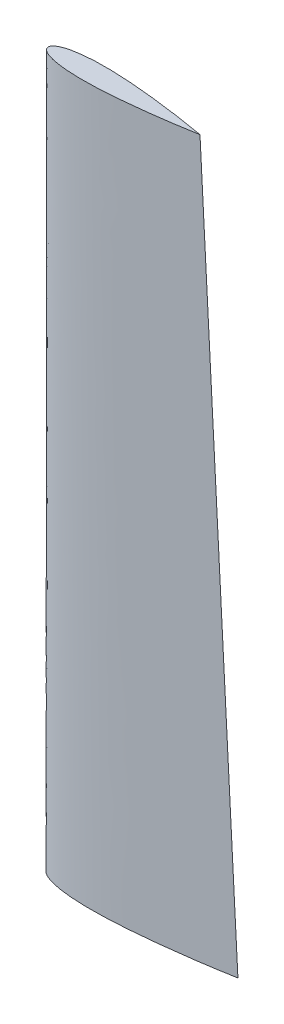
ISO-10303-21;
HEADER;
FILE_DESCRIPTION(('STEP AP214'),'2;1');
FILE_NAME('part.step','',(''),(''),'','','');
FILE_SCHEMA(('AUTOMOTIVE_DESIGN { 1 0 10303 214 1 1 1 1 }'));
ENDSEC;
DATA;
#1=APPLICATION_CONTEXT('core data for automotive mechanical design processes');
#2=APPLICATION_PROTOCOL_DEFINITION('international standard','automotive_design',2000,#1);
#3=PRODUCT_CONTEXT('',#1,'mechanical');
#4=PRODUCT('Part','Part','',(#3));
#5=PRODUCT_RELATED_PRODUCT_CATEGORY('part','',(#4));
#6=PRODUCT_DEFINITION_FORMATION('','',#4);
#7=PRODUCT_DEFINITION_CONTEXT('part definition',#1,'design');
#8=PRODUCT_DEFINITION('design','',#6,#7);
#9=PRODUCT_DEFINITION_SHAPE('','',#8);
#10=(LENGTH_UNIT() NAMED_UNIT(*) SI_UNIT(.MILLI.,.METRE.));
#11=(NAMED_UNIT(*) PLANE_ANGLE_UNIT() SI_UNIT($,.RADIAN.));
#12=(NAMED_UNIT(*) SI_UNIT($,.STERADIAN.) SOLID_ANGLE_UNIT());
#13=UNCERTAINTY_MEASURE_WITH_UNIT(LENGTH_MEASURE(1.E-05),#10,'distance_accuracy_value','');
#14=(GEOMETRIC_REPRESENTATION_CONTEXT(3) GLOBAL_UNCERTAINTY_ASSIGNED_CONTEXT((#13)) GLOBAL_UNIT_ASSIGNED_CONTEXT((#10,
#11,#12)) REPRESENTATION_CONTEXT('',''));
#15=CARTESIAN_POINT('',(0.,0.,0.));
#16=DIRECTION('',(0.,0.,1.));
#17=DIRECTION('',(1.,0.,0.));
#18=AXIS2_PLACEMENT_3D('',#15,#16,#17);
#19=CARTESIAN_POINT('',(203.971620034364,1950.0156,27.8034866468098));
#20=DIRECTION('',(0.,-1.,0.));
#21=DIRECTION('',(0.,0.,-1.));
#22=AXIS2_PLACEMENT_3D('',#19,#20,#21);
#23=PLANE('',#22);
#24=CARTESIAN_POINT('',(0.,1950.0156,0.));
#25=CARTESIAN_POINT('',(-0.000132411794141746,1950.0156,0.452618905888858));
#26=CARTESIAN_POINT('',(0.0429177215770769,1950.0156,1.18421336207311));
#27=CARTESIAN_POINT('',(0.208586844431705,1950.0156,2.2419312023707));
#28=CARTESIAN_POINT('',(0.622161630263633,1950.0156,3.61772324245558));
#29=CARTESIAN_POINT('',(1.17647795776447,1950.0156,4.89499944016805));
#30=CARTESIAN_POINT('',(1.98821144088606,1950.0156,6.28777065561724));
#31=CARTESIAN_POINT('',(3.13887362438833,1950.0156,7.82034054629599));
#32=CARTESIAN_POINT('',(4.79348179311829,1950.0156,9.56338984024537));
#33=CARTESIAN_POINT('',(7.24659332076391,1950.0156,11.6145365969839));
#34=CARTESIAN_POINT('',(10.9638369708438,1950.0156,14.0633491821183));
#35=CARTESIAN_POINT('',(16.6259900013845,1950.0156,16.9528720039565));
#36=CARTESIAN_POINT('',(25.4061014686364,1950.0156,20.3363086503743));
#37=CARTESIAN_POINT('',(38.5855729531847,1950.0156,23.9895914222989));
#38=CARTESIAN_POINT('',(58.2040990692024,1950.0156,27.6237926048993));
#39=CARTESIAN_POINT('',(83.5079066568928,1950.0156,30.2438326616507));
#40=CARTESIAN_POINT('',(109.025457267452,1950.0156,31.2723789495483));
#41=CARTESIAN_POINT('',(133.104694853235,1950.0156,31.2689535646438));
#42=CARTESIAN_POINT('',(157.172939652597,1950.0156,30.6484837170765));
#43=CARTESIAN_POINT('',(177.214559693473,1950.0156,29.6879421012117));
#44=CARTESIAN_POINT('',(197.234851963258,1950.0156,28.3717402474819));
#45=CARTESIAN_POINT('',(217.232887645858,1950.0156,26.7577290002773));
#46=CARTESIAN_POINT('',(233.217552673856,1950.0156,25.3078655328327));
#47=CARTESIAN_POINT('',(249.188599079006,1950.0156,23.7148076984486));
#48=CARTESIAN_POINT('',(265.146073826974,1950.0156,21.9914765782221));
#49=CARTESIAN_POINT('',(279.09699898134,1950.0156,20.3779984739991));
#50=CARTESIAN_POINT('',(291.046579018833,1950.0156,18.9241609261298));
#51=CARTESIAN_POINT('',(300.99867634236,1950.0156,17.6668778170728));
#52=CARTESIAN_POINT('',(308.957219413891,1950.0156,16.6340020125913));
#53=CARTESIAN_POINT('',(318.900309087508,1950.0156,15.3096650793377));
#54=CARTESIAN_POINT('',(330.826138751451,1950.0156,13.6672198997579));
#55=CARTESIAN_POINT('',(344.726608952634,1950.0156,11.6743331814659));
#56=CARTESIAN_POINT('',(360.600678070843,1950.0156,9.28875286083101));
#57=CARTESIAN_POINT('',(374.470544112453,1950.0156,7.10527419641756));
#58=CARTESIAN_POINT('',(386.355165303342,1950.0156,5.15967131522834));
#59=CARTESIAN_POINT('',(395.248775092338,1950.0156,3.65713890619943));
#60=CARTESIAN_POINT('',(400.701859779201,1950.0156,2.71711552386963));
#61=CARTESIAN_POINT('',(404.625206158942,1950.0156,2.03151108757639));
#62=CARTESIAN_POINT('',(407.65732962331,1950.0156,1.49682236833213));
#63=CARTESIAN_POINT('',(410.414684160225,1950.0156,1.00781364049175));
#64=CARTESIAN_POINT('',(413.276234016353,1950.0156,0.493399828564522));
#65=CARTESIAN_POINT('',(415.10197808183,1950.0156,0.163159357257544));
#66=CARTESIAN_POINT('',(416.,1950.0156,0.));
#67=B_SPLINE_CURVE_WITH_KNOTS('',4,(#24,#25,#26,#27,#28,#29,#30,#31,#32,#33,#34,#35,#36,#37,#38,
#39,#40,#41,#42,#43,#44,#45,#46,#47,#48,#49,#50,#51,#52,#53,#54,#55,#56,#57,#58,#59,#60,#61,#62,
#63,#64,#65,#66),.UNSPECIFIED.,.F.,.F.,(5,1,1,1,1,1,1,1,1,1,1,1,1,1,1,1,1,1,1,1,1,1,1,1,1,1,1,1,
1,1,1,1,1,1,1,1,1,1,1,5),(0.,0.00384094368668035,0.00623502344548002,0.00907229118073902,
0.0121932195027498,0.0156568391306658,0.0199171765523822,0.0253389617475663,0.032592504020504,
0.0427993875578554,0.0577045702050988,0.0793106675832992,0.112503101279865,0.158972616272418,
0.227236465354748,0.295500326385246,0.329632258035195,0.363764189685143,0.432028052899866,
0.466159984018369,0.500291915136872,0.534423847396324,0.568555779655776,0.602687711149444,
0.636819642643112,0.653885609017627,0.670951575392143,0.688017541766659,0.705083508141175,
0.739215439489715,0.773347370838255,0.807479302421558,0.841611234004862,0.858677200446661,
0.87574316688846,0.88427615010936,0.88854264171981,0.892809133330259,0.901342116551159,
0.909875099772058),.UNSPECIFIED.);
#68=CARTESIAN_POINT('',(0.,1950.0156,0.));
#69=VERTEX_POINT('',#68);
#70=CARTESIAN_POINT('',(416.,1950.0156,0.));
#71=VERTEX_POINT('',#70);
#72=EDGE_CURVE('E67',#69,#71,#67,.T.);
#73=ORIENTED_EDGE('',*,*,#72,.T.);
#74=CARTESIAN_POINT('',(416.,1950.0156,0.));
#75=CARTESIAN_POINT('',(415.10197808183,1950.0156,-0.163159357257551));
#76=CARTESIAN_POINT('',(413.276234016352,1950.0156,-0.493399828564528));
#77=CARTESIAN_POINT('',(410.414684160225,1950.0156,-1.00781364049175));
#78=CARTESIAN_POINT('',(407.65732962331,1950.0156,-1.49682236833213));
#79=CARTESIAN_POINT('',(404.625206158942,1950.0156,-2.03151108757639));
#80=CARTESIAN_POINT('',(400.701859779201,1950.0156,-2.71711552386963));
#81=CARTESIAN_POINT('',(395.248775092338,1950.0156,-3.65713890619943));
#82=CARTESIAN_POINT('',(386.355165303342,1950.0156,-5.15967131522834));
#83=CARTESIAN_POINT('',(374.470544112453,1950.0156,-7.10527419641756));
#84=CARTESIAN_POINT('',(360.600678070843,1950.0156,-9.28875286083101));
#85=CARTESIAN_POINT('',(344.726608952634,1950.0156,-11.6743331814659));
#86=CARTESIAN_POINT('',(330.826138751451,1950.0156,-13.6672198997579));
#87=CARTESIAN_POINT('',(318.900309087508,1950.0156,-15.3096650793377));
#88=CARTESIAN_POINT('',(308.957219413891,1950.0156,-16.6340020125913));
#89=CARTESIAN_POINT('',(300.99867634236,1950.0156,-17.6668778170728));
#90=CARTESIAN_POINT('',(291.046579018833,1950.0156,-18.9241609261298));
#91=CARTESIAN_POINT('',(279.09699898134,1950.0156,-20.3779984739991));
#92=CARTESIAN_POINT('',(265.146073826974,1950.0156,-21.9914765782221));
#93=CARTESIAN_POINT('',(249.188599079006,1950.0156,-23.7148076984486));
#94=CARTESIAN_POINT('',(233.217552673856,1950.0156,-25.3078655328327));
#95=CARTESIAN_POINT('',(217.232887645858,1950.0156,-26.7577290002773));
#96=CARTESIAN_POINT('',(197.234851963258,1950.0156,-28.3717402474819));
#97=CARTESIAN_POINT('',(177.214559693473,1950.0156,-29.6879421012117));
#98=CARTESIAN_POINT('',(157.172939652597,1950.0156,-30.6484837170765));
#99=CARTESIAN_POINT('',(133.104694853235,1950.0156,-31.2689535646438));
#100=CARTESIAN_POINT('',(109.025457267452,1950.0156,-31.2723789495483));
#101=CARTESIAN_POINT('',(83.5079066568928,1950.0156,-30.2438326616507));
#102=CARTESIAN_POINT('',(58.2040990692024,1950.0156,-27.6237926048993));
#103=CARTESIAN_POINT('',(38.5855729531847,1950.0156,-23.9895914222989));
#104=CARTESIAN_POINT('',(25.4061014686364,1950.0156,-20.3363086503743));
#105=CARTESIAN_POINT('',(16.6259900013845,1950.0156,-16.9528720039565));
#106=CARTESIAN_POINT('',(10.9638369708438,1950.0156,-14.0633491821183));
#107=CARTESIAN_POINT('',(7.24659332076391,1950.0156,-11.6145365969839));
#108=CARTESIAN_POINT('',(4.79348179311829,1950.0156,-9.56338984024537));
#109=CARTESIAN_POINT('',(3.13887362438833,1950.0156,-7.82034054629599));
#110=CARTESIAN_POINT('',(1.98821144088606,1950.0156,-6.28777065561724));
#111=CARTESIAN_POINT('',(1.17647795776447,1950.0156,-4.89499944016805));
#112=CARTESIAN_POINT('',(0.622161630263633,1950.0156,-3.61772324245558));
#113=CARTESIAN_POINT('',(0.208586844431705,1950.0156,-2.2419312023707));
#114=CARTESIAN_POINT('',(0.0429177215770769,1950.0156,-1.18421336207311));
#115=CARTESIAN_POINT('',(-0.000132411794141746,1950.0156,-0.452618905888858));
#116=CARTESIAN_POINT('',(0.,1950.0156,0.));
#117=B_SPLINE_CURVE_WITH_KNOTS('',4,(#74,#75,#76,#77,#78,#79,#80,#81,#82,#83,#84,#85,#86,#87,
#88,#89,#90,#91,#92,#93,#94,#95,#96,#97,#98,#99,#100,#101,#102,#103,#104,#105,#106,#107,#108,
#109,#110,#111,#112,#113,#114,#115,#116),.UNSPECIFIED.,.F.,.F.,(5,1,1,1,1,1,1,1,1,1,1,1,1,1,1,1,
1,1,1,1,1,1,1,1,1,1,1,1,1,1,1,1,1,1,1,1,1,1,1,5),(0.,0.00853298322089946,0.017065966441799,
0.0213324580522488,0.0255989496626986,0.0341319328835982,0.0511978993253973,0.0682638657671963,
0.1023957973505,0.136527728933804,0.170659660282344,0.204791591630883,0.221857558005399,
0.238923524379915,0.255989490754431,0.273055457128947,0.307187388622615,0.341319320116282,
0.375451252375734,0.409583184635186,0.443715115753689,0.477847046872192,0.546110910086915,
0.580242841736864,0.614374773386812,0.68263863441731,0.750902483499641,0.797371998492194,
0.830564432188759,0.85217052956696,0.867075712214203,0.877282595751554,0.884536138024492,
0.889957923219676,0.894218260641393,0.897681880269309,0.900802808591319,0.903640076326579,
0.906034156085378,0.909875099772058),.UNSPECIFIED.);
#118=EDGE_CURVE('E12',#71,#69,#117,.T.);
#119=ORIENTED_EDGE('',*,*,#118,.T.);
#120=EDGE_LOOP('',(#73,#119));
#121=FACE_BOUND('',#120,.T.);
#122=ADVANCED_FACE('F57',(#121),#23,.F.);
#123=CARTESIAN_POINT('',(254.964522964352,0.,34.7543586757465));
#124=DIRECTION('',(0.,-1.,0.));
#125=DIRECTION('',(0.,0.,-1.));
#126=AXIS2_PLACEMENT_3D('',#123,#124,#125);
#127=PLANE('',#126);
#128=CARTESIAN_POINT('',(0.,0.,0.));
#129=CARTESIAN_POINT('',(-0.00013983826913679,0.,0.565367364406983));
#130=CARTESIAN_POINT('',(0.0536085748995305,0.,1.48015428224065));
#131=CARTESIAN_POINT('',(0.260733417880142,0.,2.80265248649878));
#132=CARTESIAN_POINT('',(0.777708500117972,0.,4.52201985325764));
#133=CARTESIAN_POINT('',(1.47059460665834,0.,6.11883057974921));
#134=CARTESIAN_POINT('',(2.48527025374901,0.,7.85966713106478));
#135=CARTESIAN_POINT('',(3.92358988284056,0.,9.77545094344222));
#136=CARTESIAN_POINT('',(5.99185386558944,0.,11.9542213233137));
#137=CARTESIAN_POINT('',(9.05824017470996,0.,14.5181796813414));
#138=CARTESIAN_POINT('',(13.7047969029431,0.,17.5791811320274));
#139=CARTESIAN_POINT('',(20.7824867914205,0.,21.1910932345458));
#140=CARTESIAN_POINT('',(31.7576275518258,0.,25.4203838065574));
#141=CARTESIAN_POINT('',(48.2319651734341,0.,29.986990656134));
#142=CARTESIAN_POINT('',(72.7551255659186,0.,34.5297394914419));
#143=CARTESIAN_POINT('',(104.384880296408,0.,37.804792092378));
#144=CARTESIAN_POINT('',(136.281825909399,0.,39.0904724772161));
#145=CARTESIAN_POINT('',(166.380863048996,0.,39.0861931627236));
#146=CARTESIAN_POINT('',(196.466184382705,0.,38.3106027258764));
#147=CARTESIAN_POINT('',(221.518179642496,0.,37.1099313556539));
#148=CARTESIAN_POINT('',(246.543596823656,0.,35.4646694591071));
#149=CARTESIAN_POINT('',(271.541065160989,0.,33.4471693492179));
#150=CARTESIAN_POINT('',(291.522027004895,0.,31.6348162405235));
#151=CARTESIAN_POINT('',(311.485595352483,0.,29.643537525996));
#152=CARTESIAN_POINT('',(331.432868603711,0.,27.4892955095228));
#153=CARTESIAN_POINT('',(348.870798819086,0.,25.4725798420177));
#154=CARTESIAN_POINT('',(363.808919598754,0.,23.6550747317603));
#155=CARTESIAN_POINT('',(376.24721872933,0.,22.0838019816466));
#156=CARTESIAN_POINT('',(386.198630465226,0.,20.7921198439321));
#157=CARTESIAN_POINT('',(398.621470560872,0.,19.1377928055352));
#158=CARTESIAN_POINT('',(413.539698814232,0.,17.0827484458936));
#159=CARTESIAN_POINT('',(430.896668054533,0.,14.5950228163935));
#160=CARTESIAN_POINT('',(450.76857860755,0.,11.6077195558278));
#161=CARTESIAN_POINT('',(468.061090398345,0.,8.88651463919033));
#162=CARTESIAN_POINT('',(482.985517469134,0.,6.44203802018723));
#163=CARTESIAN_POINT('',(495.225051070097,0.,4.37566414837104));
#164=CARTESIAN_POINT('',(504.116850561342,0.,2.8349553025052));
#165=CARTESIAN_POINT('',(511.079622405091,0.,1.60789004266442));
#166=CARTESIAN_POINT('',(516.635293989538,0.,0.609482017940159));
#167=CARTESIAN_POINT('',(518.877472606107,0.,0.203949196805586));
#168=CARTESIAN_POINT('',(520.0000000051,0.,0.));
#169=B_SPLINE_CURVE_WITH_KNOTS('',4,(#128,#129,#130,#131,#132,#133,#134,#135,#136,#137,#138,
#139,#140,#141,#142,#143,#144,#145,#146,#147,#148,#149,#150,#151,#152,#153,#154,#155,#156,#157,
#158,#159,#160,#161,#162,#163,#164,#165,#166,#167,#168),.UNSPECIFIED.,.F.,.F.,(5,1,1,1,1,1,1,1,
1,1,1,1,1,1,1,1,1,1,1,1,1,1,1,1,1,1,1,1,1,1,1,1,1,1,1,1,1,5),(0.,0.00384094368668035,
0.00623502344548003,0.00907229118073903,0.0121932195027498,0.0156568391306658,
0.0199171765523822,0.0253389617475663,0.0325925040205041,0.0427993875578555,0.0577045702050989,
0.0793106675832995,0.112503101279865,0.158972616272418,0.227236465354749,0.295500326385247,
0.329632258035195,0.363764189685144,0.432028052899867,0.46615998401837,0.500291915136873,
0.534423847396324,0.568555779655776,0.602687711149444,0.636819642643112,0.653885609017627,
0.670951575392143,0.688017541766659,0.705083508141175,0.739215439489716,0.773347370838256,
0.80747930242156,0.841611234004863,0.858677200446662,0.875743166888461,0.89280913333026,
0.901342116551159,0.909875099772059),.UNSPECIFIED.);
#170=CARTESIAN_POINT('',(0.,0.,0.));
#171=VERTEX_POINT('',#170);
#172=CARTESIAN_POINT('',(520.0000000051,0.,9.26575530017443E-10));
#173=VERTEX_POINT('',#172);
#174=EDGE_CURVE('E91',#171,#173,#169,.T.);
#175=ORIENTED_EDGE('',*,*,#174,.F.);
#176=CARTESIAN_POINT('',(520.0000000051,0.,9.26575530017443E-10));
#177=CARTESIAN_POINT('',(518.877472606107,0.,-0.20394919588105));
#178=CARTESIAN_POINT('',(516.635293989539,0.,-0.609482017019616));
#179=CARTESIAN_POINT('',(511.079622405094,0.,-1.60789004175377));
#180=CARTESIAN_POINT('',(504.116850561347,0.,-2.83495530160696));
#181=CARTESIAN_POINT('',(495.225051070105,0.,-4.37566414748864));
#182=CARTESIAN_POINT('',(482.985517469146,0.,-6.44203801932663));
#183=CARTESIAN_POINT('',(468.061090398361,0.,-8.88651463835633));
#184=CARTESIAN_POINT('',(450.768578607571,0.,-11.6077195550247));
#185=CARTESIAN_POINT('',(430.896668054559,0.,-14.5950228156257));
#186=CARTESIAN_POINT('',(413.539698814262,0.,-17.0827484451568));
#187=CARTESIAN_POINT('',(398.621470560906,0.,-19.1377928048249));
#188=CARTESIAN_POINT('',(386.198630465263,0.,-20.792119843244));
#189=CARTESIAN_POINT('',(376.247218729369,0.,-22.0838019809762));
#190=CARTESIAN_POINT('',(363.808919598796,0.,-23.6550747311121));
#191=CARTESIAN_POINT('',(348.870798819132,0.,-25.4725798413961));
#192=CARTESIAN_POINT('',(331.43286860376,0.,-27.4892955089323));
#193=CARTESIAN_POINT('',(311.485595352536,0.,-29.643537525441));
#194=CARTESIAN_POINT('',(291.522027004951,0.,-31.6348162400041));
#195=CARTESIAN_POINT('',(271.541065161048,0.,-33.4471693487341));
#196=CARTESIAN_POINT('',(246.543596823719,0.,-35.4646694586678));
#197=CARTESIAN_POINT('',(221.518179642562,0.,-37.1099313552592));
#198=CARTESIAN_POINT('',(196.466184382773,0.,-38.3106027255263));
#199=CARTESIAN_POINT('',(166.380863049065,0.,-39.0861931624272));
#200=CARTESIAN_POINT('',(136.281825909469,0.,-39.0904724769733));
#201=CARTESIAN_POINT('',(104.384880296475,0.,-37.804792092192));
#202=CARTESIAN_POINT('',(72.7551255659802,0.,-34.5297394913122));
#203=CARTESIAN_POINT('',(48.2319651734875,0.,-29.986990656048));
#204=CARTESIAN_POINT('',(31.7576275518711,0.,-25.4203838065008));
#205=CARTESIAN_POINT('',(20.7824867914582,0.,-21.1910932345087));
#206=CARTESIAN_POINT('',(13.7047969029744,0.,-17.579181132003));
#207=CARTESIAN_POINT('',(9.05824017473583,0.,-14.5181796813253));
#208=CARTESIAN_POINT('',(5.99185386561074,0.,-11.9542213233031));
#209=CARTESIAN_POINT('',(3.92358988285798,0.,-9.77545094343524));
#210=CARTESIAN_POINT('',(2.48527025376301,0.,-7.85966713106035));
#211=CARTESIAN_POINT('',(1.47059460666925,0.,-6.11883057974659));
#212=CARTESIAN_POINT('',(0.777708500126029,0.,-4.52201985325625));
#213=CARTESIAN_POINT('',(0.260733417885136,0.,-2.80265248649832));
#214=CARTESIAN_POINT('',(0.0536085749021679,0.,-1.48015428224056));
#215=CARTESIAN_POINT('',(-0.00013983826812941,0.,-0.565367364406984));
#216=CARTESIAN_POINT('',(0.,0.,0.));
#217=B_SPLINE_CURVE_WITH_KNOTS('',4,(#176,#177,#178,#179,#180,#181,#182,#183,#184,#185,#186,
#187,#188,#189,#190,#191,#192,#193,#194,#195,#196,#197,#198,#199,#200,#201,#202,#203,#204,#205,
#206,#207,#208,#209,#210,#211,#212,#213,#214,#215,#216),.UNSPECIFIED.,.F.,.F.,(5,1,1,1,1,1,1,1,
1,1,1,1,1,1,1,1,1,1,1,1,1,1,1,1,1,1,1,1,1,1,1,1,1,1,1,1,1,5),(0.,0.00853298322089957,
0.017065966441799,0.0341319328835981,0.051197899325397,0.068263865767196,0.102395797350499,
0.136527728933803,0.170659660282343,0.204791591630884,0.2218575580054,0.238923524379916,
0.255989490754432,0.273055457128947,0.307187388622615,0.341319320116283,0.375451252375735,
0.409583184635187,0.443715115753689,0.477847046872193,0.546110910086915,0.580242841736864,
0.614374773386812,0.68263863441731,0.750902483499641,0.797371998492194,0.83056443218876,
0.85217052956696,0.867075712214204,0.877282595751555,0.884536138024493,0.889957923219677,
0.894218260641393,0.897681880269309,0.90080280859132,0.903640076326579,0.906034156085379,
0.909875099772059),.UNSPECIFIED.);
#218=EDGE_CURVE('E95',#173,#171,#217,.T.);
#219=ORIENTED_EDGE('',*,*,#218,.F.);
#220=EDGE_LOOP('',(#175,#219));
#221=FACE_BOUND('',#220,.T.);
#222=ADVANCED_FACE('F104',(#221),#127,.T.);
#223=CARTESIAN_POINT('',(0.,0.,0.));
#224=CARTESIAN_POINT('',(0.,1950.0156,0.));
#225=CARTESIAN_POINT('',(-0.000172531600551068,0.,0.697546793754039));
#226=CARTESIAN_POINT('',(-0.000163368861157486,1950.0156,0.558438435735316));
#227=CARTESIAN_POINT('',(0.11464346517769,0.,2.08863625917968));
#228=CARTESIAN_POINT('',(0.0934210763306065,1950.0156,1.6725330096644));
#229=CARTESIAN_POINT('',(0.792023266437783,0.,4.80054150476434));
#230=CARTESIAN_POINT('',(0.63256106255709,1950.0156,3.83980783642141));
#231=CARTESIAN_POINT('',(2.40192767634038,0.,7.92616671453191));
#232=CARTESIAN_POINT('',(1.92204378289568,1950.0156,6.34133989730001));
#233=CARTESIAN_POINT('',(5.10609194853926,0.,11.1315900608463));
#234=CARTESIAN_POINT('',(4.08466708521383,1950.0156,8.90496334244988));
#235=CARTESIAN_POINT('',(8.2655830192547,0.,13.8802658830743));
#236=CARTESIAN_POINT('',(6.6125522412294,1950.01560000001,11.1044104642717));
#237=CARTESIAN_POINT('',(11.7025651176183,0.,16.2630031693881));
#238=CARTESIAN_POINT('',(9.36200445070419,1950.0156,13.0102655268894));
#239=CARTESIAN_POINT('',(15.3198040319678,0.,18.3601763762869));
#240=CARTESIAN_POINT('',(12.2558665950688,1950.0156,14.68821877089));
#241=CARTESIAN_POINT('',(19.0595017791553,0.,20.2265711339963));
#242=CARTESIAN_POINT('',(15.2475896848503,1950.0156,16.181214777707));
#243=CARTESIAN_POINT('',(22.8877703915684,0.,21.9042068646662));
#244=CARTESIAN_POINT('',(18.3102235083317,1950.0156,17.5233856693363));
#245=CARTESIAN_POINT('',(26.7802720428846,0.,23.4234847836171));
#246=CARTESIAN_POINT('',(21.424197929494,1950.0156,18.7387751402896));
#247=CARTESIAN_POINT('',(30.7240628676559,0.,24.8073836054409));
#248=CARTESIAN_POINT('',(24.5792604643147,1950.0156,19.8459093236542));
#249=CARTESIAN_POINT('',(34.7050413936871,0.,26.0740900585751));
#250=CARTESIAN_POINT('',(27.7639278554083,1950.0156,20.8592600371792));
#251=CARTESIAN_POINT('',(40.0583344054226,0.,27.6267061218937));
#252=CARTESIAN_POINT('',(32.0467379462036,1950.0156,22.1013684075324));
#253=CARTESIAN_POINT('',(46.8072436314092,0.,29.3359302682788));
#254=CARTESIAN_POINT('',(37.4457552920273,1950.0156,23.4687460682822));
#255=CARTESIAN_POINT('',(54.9809315965138,0.,31.0917884350091));
#256=CARTESIAN_POINT('',(43.984766965363,1950.0156,24.8734279545148));
#257=CARTESIAN_POINT('',(63.2001192484732,0.,32.5968740775452));
#258=CARTESIAN_POINT('',(50.5600809124636,1950.0156,26.0775008040538));
#259=CARTESIAN_POINT('',(71.4581355741932,0.,33.8865505100785));
#260=CARTESIAN_POINT('',(57.1665210988501,1950.0156,27.1092406644904));
#261=CARTESIAN_POINT('',(79.7417679380136,0.,34.9888074299073));
#262=CARTESIAN_POINT('',(63.7933981728274,1950.0156,27.9910440280568));
#263=CARTESIAN_POINT('',(88.0461154243765,0.,35.9251527825591));
#264=CARTESIAN_POINT('',(70.4368940229747,1950.0156,28.7401209628204));
#265=CARTESIAN_POINT('',(96.3657716965214,0.,36.7116879209793));
#266=CARTESIAN_POINT('',(77.0926172932113,1950.0156,29.3693509900585));
#267=CARTESIAN_POINT('',(104.697370219274,0.,37.3630705182603));
#268=CARTESIAN_POINT('',(83.757897981905,1950.0156,29.8904562721366));
#269=CARTESIAN_POINT('',(113.037505117324,0.,37.8918238812336));
#270=CARTESIAN_POINT('',(90.4300027043139,1950.0156,30.3134588958092));
#271=CARTESIAN_POINT('',(121.383827566662,0.,38.3087132630668));
#272=CARTESIAN_POINT('',(97.1070607446774,1950.0156,30.6469708953454));
#273=CARTESIAN_POINT('',(129.734546455778,0.,38.6224657288897));
#274=CARTESIAN_POINT('',(103.787639351327,1950.0156,30.897972543475));
#275=CARTESIAN_POINT('',(138.088319093189,0.,38.8405401761418));
#276=CARTESIAN_POINT('',(110.470654165108,1950.0156,31.0724332661246));
#277=CARTESIAN_POINT('',(146.444079358072,0.,38.9699679053287));
#278=CARTESIAN_POINT('',(117.155262147401,1950.0156,31.1759724678797));
#279=CARTESIAN_POINT('',(157.58602494687,0.,39.0325565518692));
#280=CARTESIAN_POINT('',(126.068826136677,1950.0156,31.2260484641539));
#281=CARTESIAN_POINT('',(171.514009801604,0.,38.9192813819203));
#282=CARTESIAN_POINT('',(137.211202235855,1950.0156,31.1354234561562));
#283=CARTESIAN_POINT('',(188.222528409941,0.,38.5153300193836));
#284=CARTESIAN_POINT('',(150.578023539456,1950.0156,30.8122650909803));
#285=CARTESIAN_POINT('',(204.923816269505,0.,37.8746672599144));
#286=CARTESIAN_POINT('',(163.939051544541,1950.0156,30.2997332235397));
#287=CARTESIAN_POINT('',(221.615612576564,0.,37.0238944810584));
#288=CARTESIAN_POINT('',(177.292497438802,1950.0156,29.6191152241738));
#289=CARTESIAN_POINT('',(238.296749552589,0.,35.9858507854901));
#290=CARTESIAN_POINT('',(190.637388402938,1950.0156,28.7886810512032));
#291=CARTESIAN_POINT('',(254.966472538384,0.,34.7796952066743));
#292=CARTESIAN_POINT('',(203.973188912969,1950.0156,27.8237547947193));
#293=CARTESIAN_POINT('',(271.624504719967,0.,33.421513673594));
#294=CARTESIAN_POINT('',(217.299604920871,1950.0156,26.737210032764));
#295=CARTESIAN_POINT('',(288.270809837955,0.,31.9254964754224));
#296=CARTESIAN_POINT('',(230.616641947052,1950.0156,25.5403993997399));
#297=CARTESIAN_POINT('',(304.904910824354,0.,30.3031401509569));
#298=CARTESIAN_POINT('',(243.923910284162,1950.01560000001,24.2425131995244));
#299=CARTESIAN_POINT('',(321.527767845153,0.,28.5641164006777));
#300=CARTESIAN_POINT('',(257.222336555524,1950.0156,22.8512770152699));
#301=CARTESIAN_POINT('',(338.138198440347,0.,26.7165305588768));
#302=CARTESIAN_POINT('',(270.510180987081,1950.0156,21.3732812364424));
#303=CARTESIAN_POINT('',(354.737690495948,0.,24.7664004935537));
#304=CARTESIAN_POINT('',(283.790891132657,1950.0156,19.8130017490417));
#305=CARTESIAN_POINT('',(371.324480059911,0.,22.718733849394));
#306=CARTESIAN_POINT('',(297.058284207572,1950.0156,18.1752030885099));
#307=CARTESIAN_POINT('',(387.900473993443,0.,20.5765960540875));
#308=CARTESIAN_POINT('',(310.323198046284,1950.0156,16.4607965967664));
#309=CARTESIAN_POINT('',(404.462108341463,0.,18.3422244220504));
#310=CARTESIAN_POINT('',(323.564967693237,1950.0156,14.6745952222305));
#311=CARTESIAN_POINT('',(421.0171471848,0.,16.0154235483386));
#312=CARTESIAN_POINT('',(336.822592077327,1950.0156,12.8107714397611));
#313=CARTESIAN_POINT('',(437.541495115356,0.,13.5986106079921));
#314=CARTESIAN_POINT('',(350.016771938349,1950.0156,10.8818374242814));
#315=CARTESIAN_POINT('',(454.095791922086,0.,11.0813419211522));
#316=CARTESIAN_POINT('',(363.302737361386,1950.0156,8.86030581900217));
#317=CARTESIAN_POINT('',(470.542706954278,0.,8.48123679697672));
#318=CARTESIAN_POINT('',(376.391905727351,1950.0156,6.79283794717999));
#319=CARTESIAN_POINT('',(484.374898507382,0.,6.20846487534326));
#320=CARTESIAN_POINT('',(387.568761370836,1950.0156,4.95391293183949));
#321=CARTESIAN_POINT('',(495.318281984993,0.,4.35451021143456));
#322=CARTESIAN_POINT('',(396.180606721381,1950.0156,3.49753360544799));
#323=CARTESIAN_POINT('',(506.167977271118,0.,2.48327743760662));
#324=CARTESIAN_POINT('',(404.920348173364,1950.0156,1.98793093575005));
#325=CARTESIAN_POINT('',(515.012687329123,0.,0.906132371821215));
#326=CARTESIAN_POINT('',(412.010149863769,1950.0156,0.724905896626429));
#327=CARTESIAN_POINT('',(520.0000000051,0.,0.));
#328=CARTESIAN_POINT('',(416.,1950.0156,0.));
#329=B_SPLINE_SURFACE_WITH_KNOTS('',3,1,((#223,#224),(#225,#226),(#227,#228),(#229,#230),(#231,
#232),(#233,#234),(#235,#236),(#237,#238),(#239,#240),(#241,#242),(#243,#244),(#245,#246),(#247,
#248),(#249,#250),(#251,#252),(#253,#254),(#255,#256),(#257,#258),(#259,#260),(#261,#262),(#263,
#264),(#265,#266),(#267,#268),(#269,#270),(#271,#272),(#273,#274),(#275,#276),(#277,#278),(#279,
#280),(#281,#282),(#283,#284),(#285,#286),(#287,#288),(#289,#290),(#291,#292),(#293,#294),(#295,
#296),(#297,#298),(#299,#300),(#301,#302),(#303,#304),(#305,#306),(#307,#308),(#309,#310),(#311,
#312),(#313,#314),(#315,#316),(#317,#318),(#319,#320),(#321,#322),(#323,#324),(#325,#326),(#327,
#328)),.UNSPECIFIED.,.F.,.F.,.F.,(4,1,1,1,1,1,1,1,1,1,1,1,1,1,1,1,1,1,1,1,1,1,1,1,1,1,1,1,1,1,1,
1,1,1,1,1,1,1,1,1,1,1,1,1,1,1,1,1,1,1,4),(2,2),(0.,0.00390625,0.0078125,0.015625,0.0234375,
0.03125,0.0390625,0.046875,0.0546875,0.0625,0.0703125,0.078125,0.0859375,0.09375,0.109375,0.125,
0.140625,0.15625,0.171875,0.1875,0.203125,0.21875,0.234375,0.25,0.265625,0.28125,0.296875,
0.3125,0.34375,0.375,0.40625,0.4375,0.46875,0.5,0.53125,0.5625,0.59375,0.625,0.65625,0.6875,
0.71875,0.75,0.78125,0.8125,0.84375,0.875,0.90625,0.9375,0.953125,0.96875,1.),(0.,1.),.UNSPECIFIED.);
#330=DIRECTION('',(-0.0532572180694658,0.998580827336226,0.));
#331=VECTOR('',#330,1.);
#332=CARTESIAN_POINT('',(468.00000000255,975.0078,0.));
#333=LINE('',#332,#331);
#334=EDGE_CURVE('E75',#173,#71,#333,.T.);
#335=DIRECTION('',(0.,-1.,0.));
#336=VECTOR('',#335,1.);
#337=CARTESIAN_POINT('',(0.,975.0078,0.));
#338=LINE('',#337,#336);
#339=EDGE_CURVE('E87',#69,#171,#338,.T.);
#340=ORIENTED_EDGE('',*,*,#174,.T.);
#341=ORIENTED_EDGE('',*,*,#334,.T.);
#342=ORIENTED_EDGE('',*,*,#72,.F.);
#343=ORIENTED_EDGE('',*,*,#339,.T.);
#344=EDGE_LOOP('',(#340,#341,#342,#343));
#345=FACE_BOUND('',#344,.T.);
#346=ADVANCED_FACE('F89',(#345),#329,.T.);
#347=CARTESIAN_POINT('',(520.0000000051,0.,9.26575530017443E-10));
#348=CARTESIAN_POINT('',(416.,1950.0156,0.));
#349=CARTESIAN_POINT('',(515.012687329124,0.,-0.906132370903552));
#350=CARTESIAN_POINT('',(412.010149863769,1950.0156,-0.724905896626426));
#351=CARTESIAN_POINT('',(506.203952608167,0.,-2.476978479369));
#352=CARTESIAN_POINT('',(404.920348173346,1950.0156,-1.98793093575233));
#353=CARTESIAN_POINT('',(495.312906966115,0.,-4.35542903466934));
#354=CARTESIAN_POINT('',(396.180606721391,1950.0156,-3.49753360544688));
#355=CARTESIAN_POINT('',(484.399727532738,0.,-6.20434173484594));
#356=CARTESIAN_POINT('',(387.56876137086,1950.0156,-4.95391293183651));
#357=CARTESIAN_POINT('',(470.528547997302,0.,-8.48355531915077));
#358=CARTESIAN_POINT('',(376.391905727275,1950.0156,-6.79283794718842));
#359=CARTESIAN_POINT('',(454.103609702044,0.,-11.0800829790732));
#360=CARTESIAN_POINT('',(363.302737361529,1950.0156,-8.86030581898724));
#361=CARTESIAN_POINT('',(437.537152798867,0.,-13.5992982401251));
#362=CARTESIAN_POINT('',(350.016771938106,1950.0156,-10.8818374243043));
#363=CARTESIAN_POINT('',(421.019227282932,0.,-16.015099904299));
#364=CARTESIAN_POINT('',(336.82259207768,1950.0156,-12.8107714397359));
#365=CARTESIAN_POINT('',(404.461078879316,0.,-18.3423810479518));
#366=CARTESIAN_POINT('',(323.564967692923,1950.0156,-14.6745952222223));
#367=CARTESIAN_POINT('',(387.901034105605,0.,-20.57651237893));
#368=CARTESIAN_POINT('',(310.32319804668,1950.0156,-16.4607965967984));
#369=CARTESIAN_POINT('',(371.32420793789,0.,-22.7187737885873));
#370=CARTESIAN_POINT('',(297.058284206964,1950.0156,-18.1752030884443));
#371=CARTESIAN_POINT('',(354.73784583066,0.,-24.7663781917344));
#372=CARTESIAN_POINT('',(283.790891133872,1950.0156,-19.8130017491833));
#373=CARTESIAN_POINT('',(338.138125534913,0.,-26.716540775323));
#374=CARTESIAN_POINT('',(270.510180984717,1950.0156,-21.3732812361606));
#375=CARTESIAN_POINT('',(321.527804989284,0.,-28.5641113113219));
#376=CARTESIAN_POINT('',(257.222336560157,1950.0156,-22.8512770158249));
#377=CARTESIAN_POINT('',(304.904888390369,0.,-30.3031431454657));
#378=CARTESIAN_POINT('',(243.923910274593,1950.0156,-24.2425131983829));
#379=CARTESIAN_POINT('',(288.270821983309,0.,-31.9254949122937));
#380=CARTESIAN_POINT('',(230.616641964261,1950.0156,-25.5403994017344));
#381=CARTESIAN_POINT('',(271.62449852074,0.,-33.4215144307311));
#382=CARTESIAN_POINT('',(217.299604889092,1950.0156,-26.7372100295475));
#383=CARTESIAN_POINT('',(254.966475930058,0.,-34.7796948396908));
#384=CARTESIAN_POINT('',(203.973188992573,1950.0156,-27.823754799632));
#385=CARTESIAN_POINT('',(238.296747168107,0.,-35.9858509972351));
#386=CARTESIAN_POINT('',(190.63738806826,1950.0156,-28.7886810544587));
#387=CARTESIAN_POINT('',(221.615614971914,0.,-37.0238943361184));
#388=CARTESIAN_POINT('',(177.292498428797,1950.0156,-29.6191151948889));
#389=CARTESIAN_POINT('',(204.923813002645,0.,-37.8746673823702));
#390=CARTESIAN_POINT('',(163.939049703864,1950.0156,-30.299733270004));
#391=CARTESIAN_POINT('',(188.22253331251,0.,-38.515329903152));
#392=CARTESIAN_POINT('',(150.578026982374,1950.0156,-30.8122650221039));
#393=CARTESIAN_POINT('',(171.514000060266,0.,-38.9192815201847));
#394=CARTESIAN_POINT('',(137.211194911448,1950.0156,-31.1354235569458));
#395=CARTESIAN_POINT('',(157.586039543516,0.,-39.0325564242079));
#396=CARTESIAN_POINT('',(126.068838449185,1950.0156,-31.2260483729162));
#397=CARTESIAN_POINT('',(146.444080589122,0.,-38.9699680262407));
#398=CARTESIAN_POINT('',(117.155262515161,1950.0156,-31.1759725599765));
#399=CARTESIAN_POINT('',(138.088317474994,0.,-38.8405400725367));
#400=CARTESIAN_POINT('',(110.470653171469,1950.0156,-31.0724331731195));
#401=CARTESIAN_POINT('',(129.734547505652,0.,-38.6224658206681));
#402=CARTESIAN_POINT('',(103.787640152789,1950.0156,-30.8979726520013));
#403=CARTESIAN_POINT('',(121.383826631125,0.,-38.3087131528815));
#404=CARTESIAN_POINT('',(97.1070599841975,1950.0156,-30.6469707391729));
#405=CARTESIAN_POINT('',(113.03750625255,0.,-37.8918240593555));
#406=CARTESIAN_POINT('',(90.4300038364969,1950.0156,-30.3134591825328));
#407=CARTESIAN_POINT('',(104.697368128098,0.,-37.3630701730868));
#408=CARTESIAN_POINT('',(83.7578962562684,1950.0156,-29.8904558036571));
#409=CARTESIAN_POINT('',(96.3657754407107,0.,-36.7116885816502));
#410=CARTESIAN_POINT('',(77.0926202072873,1950.0156,-29.3693517937348));
#411=CARTESIAN_POINT('',(88.0461085622357,0.,-35.9251515047921));
#412=CARTESIAN_POINT('',(70.43688861989,1950.0156,-28.7401194653004));
#413=CARTESIAN_POINT('',(79.741780479666,0.,-34.9888098763348));
#414=CARTESIAN_POINT('',(63.7934093122829,1950.0156,-27.991047120062));
#415=CARTESIAN_POINT('',(71.4581122760663,0.,-33.8865457071142));
#416=CARTESIAN_POINT('',(57.1665019402574,1950.0156,-27.1092353448837));
#417=CARTESIAN_POINT('',(63.2001628290909,0.,-32.5968835974926));
#418=CARTESIAN_POINT('',(50.5601158527999,1950.0156,-26.0775105065646));
#419=CARTESIAN_POINT('',(54.9808497029428,0.,-31.0917693991861));
#420=CARTESIAN_POINT('',(43.9847017355438,1950.0156,-24.8734098405319));
#421=CARTESIAN_POINT('',(46.807404689019,0.,-29.3359699999941));
#422=CARTESIAN_POINT('',(37.4458835327111,1950.0156,-23.4687816801118));
#423=CARTESIAN_POINT('',(40.0580466351641,0.,-27.6266310271009));
#424=CARTESIAN_POINT('',(32.0465084729197,1950.0156,-22.1013046849029));
#425=CARTESIAN_POINT('',(34.7050657728564,0.,-26.0740939293317));
#426=CARTESIAN_POINT('',(27.7639455652794,1950.0156,-20.8592649520028));
#427=CARTESIAN_POINT('',(30.7240596310849,0.,-24.8073844820751));
#428=CARTESIAN_POINT('',(24.5792599185414,1950.0156,-19.8459091737779));
#429=CARTESIAN_POINT('',(26.7802726166724,0.,-23.4234840486154));
#430=CARTESIAN_POINT('',(21.4241971187592,1950.0156,-18.7387749141702));
#431=CARTESIAN_POINT('',(22.8877701641407,0.,-21.9042071525943));
#432=CARTESIAN_POINT('',(18.3102240118059,1950.0156,-17.5233858096354));
#433=CARTESIAN_POINT('',(19.059501989139,0.,-20.2265712951772));
#434=CARTESIAN_POINT('',(15.247589411441,1950.0156,-16.1812147015314));
#435=CARTESIAN_POINT('',(15.3198037321811,0.,-18.3601757079169));
#436=CARTESIAN_POINT('',(12.2558667337477,1950.0156,-14.6882188095264));
#437=CARTESIAN_POINT('',(11.7025656447848,0.,-16.2630046372554));
#438=CARTESIAN_POINT('',(9.36200438111888,1950.0156,-13.0102655075029));
#439=CARTESIAN_POINT('',(8.26558218934389,0.,-13.8802634499712));
#440=CARTESIAN_POINT('',(6.61255227776969,1950.0156,-11.1044104744518));
#441=CARTESIAN_POINT('',(5.10609336570165,0.,-11.1315942819647));
#442=CARTESIAN_POINT('',(4.08466706683852,1950.0156,-8.90496333733053));
#443=CARTESIAN_POINT('',(2.40192491102679,0.,-7.92615843610148));
#444=CARTESIAN_POINT('',(1.92204379182041,1950.0156,-6.34133989978644));
#445=CARTESIAN_POINT('',(0.792027909441686,0.,-4.80055543062025));
#446=CARTESIAN_POINT('',(0.632561060165425,1950.0156,-3.83980783575505));
#447=CARTESIAN_POINT('',(0.114642923206646,0.,-2.08863462332485));
#448=CARTESIAN_POINT('',(0.0934210751668709,1950.0156,-1.67253300934018));
#449=CARTESIAN_POINT('',(-0.000172531599308171,0.,-0.697546793754047));
#450=CARTESIAN_POINT('',(-0.000163368861157488,1950.0156,-0.558438435735322));
#451=CARTESIAN_POINT('',(0.,0.,0.));
#452=CARTESIAN_POINT('',(0.,1950.0156,0.));
#453=B_SPLINE_SURFACE_WITH_KNOTS('',3,1,((#347,#348),(#349,#350),(#351,#352),(#353,#354),(#355,
#356),(#357,#358),(#359,#360),(#361,#362),(#363,#364),(#365,#366),(#367,#368),(#369,#370),(#371,
#372),(#373,#374),(#375,#376),(#377,#378),(#379,#380),(#381,#382),(#383,#384),(#385,#386),(#387,
#388),(#389,#390),(#391,#392),(#393,#394),(#395,#396),(#397,#398),(#399,#400),(#401,#402),(#403,
#404),(#405,#406),(#407,#408),(#409,#410),(#411,#412),(#413,#414),(#415,#416),(#417,#418),(#419,
#420),(#421,#422),(#423,#424),(#425,#426),(#427,#428),(#429,#430),(#431,#432),(#433,#434),(#435,
#436),(#437,#438),(#439,#440),(#441,#442),(#443,#444),(#445,#446),(#447,#448),(#449,#450),(#451,
#452)),.UNSPECIFIED.,.F.,.F.,.F.,(4,1,1,1,1,1,1,1,1,1,1,1,1,1,1,1,1,1,1,1,1,1,1,1,1,1,1,1,1,1,1,
1,1,1,1,1,1,1,1,1,1,1,1,1,1,1,1,1,1,1,4),(2,2),(0.,0.03125,0.046875,0.0625,0.09375,0.125,
0.15625,0.1875,0.21875,0.25,0.28125,0.3125,0.34375,0.375,0.40625,0.4375,0.46875,0.5,0.53125,
0.5625,0.59375,0.625,0.65625,0.6875,0.703125,0.71875,0.734375,0.75,0.765625,0.78125,0.796875,
0.8125,0.828125,0.84375,0.859375,0.875,0.890625,0.90625,0.9140625,0.921875,0.9296875,0.9375,
0.9453125,0.953125,0.9609375,0.96875,0.9765625,0.984375,0.9921875,0.99609375,1.),(0.,1.),.UNSPECIFIED.);
#454=ORIENTED_EDGE('',*,*,#218,.T.);
#455=ORIENTED_EDGE('',*,*,#339,.F.);
#456=ORIENTED_EDGE('',*,*,#118,.F.);
#457=ORIENTED_EDGE('',*,*,#334,.F.);
#458=EDGE_LOOP('',(#454,#455,#456,#457));
#459=FACE_BOUND('',#458,.T.);
#460=ADVANCED_FACE('F98',(#459),#453,.T.);
#461=CLOSED_SHELL('',(#122,#222,#346,#460));
#462=MANIFOLD_SOLID_BREP('B2',#461);
#463=ADVANCED_BREP_SHAPE_REPRESENTATION('',(#18,#462),#14);
#464=SHAPE_DEFINITION_REPRESENTATION(#9,#463);
ENDSEC;
END-ISO-10303-21;
